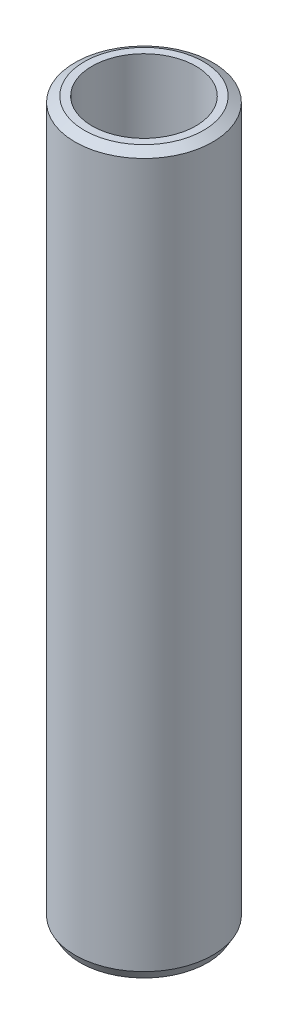
ISO-10303-21;
HEADER;
FILE_DESCRIPTION(('STEP AP214'),'2;1');
FILE_NAME('part.step','',(''),(''),'','','');
FILE_SCHEMA(('AUTOMOTIVE_DESIGN { 1 0 10303 214 1 1 1 1 }'));
ENDSEC;
DATA;
#1=APPLICATION_CONTEXT('core data for automotive mechanical design processes');
#2=APPLICATION_PROTOCOL_DEFINITION('international standard','automotive_design',2000,#1);
#3=PRODUCT_CONTEXT('',#1,'mechanical');
#4=PRODUCT('Part','Part','',(#3));
#5=PRODUCT_RELATED_PRODUCT_CATEGORY('part','',(#4));
#6=PRODUCT_DEFINITION_FORMATION('','',#4);
#7=PRODUCT_DEFINITION_CONTEXT('part definition',#1,'design');
#8=PRODUCT_DEFINITION('design','',#6,#7);
#9=PRODUCT_DEFINITION_SHAPE('','',#8);
#10=(LENGTH_UNIT() NAMED_UNIT(*) SI_UNIT(.MILLI.,.METRE.));
#11=(NAMED_UNIT(*) PLANE_ANGLE_UNIT() SI_UNIT($,.RADIAN.));
#12=(NAMED_UNIT(*) SI_UNIT($,.STERADIAN.) SOLID_ANGLE_UNIT());
#13=UNCERTAINTY_MEASURE_WITH_UNIT(LENGTH_MEASURE(1.E-05),#10,'distance_accuracy_value','');
#14=(GEOMETRIC_REPRESENTATION_CONTEXT(3) GLOBAL_UNCERTAINTY_ASSIGNED_CONTEXT((#13)) GLOBAL_UNIT_ASSIGNED_CONTEXT((#10,
#11,#12)) REPRESENTATION_CONTEXT('',''));
#15=CARTESIAN_POINT('',(0.,0.,0.));
#16=DIRECTION('',(0.,0.,1.));
#17=DIRECTION('',(1.,0.,0.));
#18=AXIS2_PLACEMENT_3D('',#15,#16,#17);
#19=CARTESIAN_POINT('',(0.,600.,0.));
#20=DIRECTION('',(0.,-1.,0.));
#21=DIRECTION('',(0.,0.,-1.));
#22=AXIS2_PLACEMENT_3D('',#19,#20,#21);
#23=CYLINDRICAL_SURFACE('',#22,57.5);
#24=CARTESIAN_POINT('',(0.,595.505160988758,0.));
#25=DIRECTION('',(0.,1.,0.));
#26=DIRECTION('',(0.,0.,1.));
#27=AXIS2_PLACEMENT_3D('',#24,#25,#26);
#28=CIRCLE('',#27,57.5);
#29=CARTESIAN_POINT('',(0.,595.505160988758,57.5));
#30=VERTEX_POINT('',#29);
#31=EDGE_CURVE('E50',#30,#30,#28,.F.);
#32=ORIENTED_EDGE('',*,*,#31,.T.);
#33=EDGE_LOOP('',(#32));
#34=FACE_BOUND('',#33,.T.);
#35=CARTESIAN_POINT('',(0.,7.78528953931412,0.));
#36=DIRECTION('',(0.,1.,0.));
#37=DIRECTION('',(0.,0.,1.));
#38=AXIS2_PLACEMENT_3D('',#35,#36,#37);
#39=CIRCLE('',#38,57.5);
#40=CARTESIAN_POINT('',(0.,7.78528953931412,57.5));
#41=VERTEX_POINT('',#40);
#42=EDGE_CURVE('E51',#41,#41,#39,.T.);
#43=ORIENTED_EDGE('',*,*,#42,.T.);
#44=EDGE_LOOP('',(#43));
#45=FACE_BOUND('',#44,.T.);
#46=ADVANCED_FACE('F39',(#34,#45),#23,.T.);
#47=CARTESIAN_POINT('',(0.,600.,0.));
#48=DIRECTION('',(0.,1.,0.));
#49=DIRECTION('',(0.,0.,1.));
#50=AXIS2_PLACEMENT_3D('',#47,#48,#49);
#51=PLANE('',#50);
#52=CARTESIAN_POINT('',(0.,600.,0.));
#53=DIRECTION('',(0.,1.,0.));
#54=DIRECTION('',(0.,0.,1.));
#55=AXIS2_PLACEMENT_3D('',#52,#53,#54);
#56=CIRCLE('',#55,49.7147104606859);
#57=CARTESIAN_POINT('',(0.,600.,49.7147104606859));
#58=VERTEX_POINT('',#57);
#59=EDGE_CURVE('E54',#58,#58,#56,.T.);
#60=ORIENTED_EDGE('',*,*,#59,.T.);
#61=EDGE_LOOP('',(#60));
#62=FACE_BOUND('',#61,.T.);
#63=CARTESIAN_POINT('',(0.,600.,0.));
#64=DIRECTION('',(0.,1.,0.));
#65=DIRECTION('',(0.,0.,1.));
#66=AXIS2_PLACEMENT_3D('',#63,#64,#65);
#67=CIRCLE('',#66,43.2916691874936);
#68=CARTESIAN_POINT('',(0.,600.,43.2916691874936));
#69=VERTEX_POINT('',#68);
#70=EDGE_CURVE('E58',#69,#69,#67,.T.);
#71=ORIENTED_EDGE('',*,*,#70,.F.);
#72=EDGE_LOOP('',(#71));
#73=FACE_BOUND('',#72,.T.);
#74=ADVANCED_FACE('F69',(#62,#73),#51,.T.);
#75=CARTESIAN_POINT('',(0.,0.,0.));
#76=DIRECTION('',(0.,1.,0.));
#77=DIRECTION('',(0.,0.,1.));
#78=AXIS2_PLACEMENT_3D('',#75,#76,#77);
#79=PLANE('',#78);
#80=CARTESIAN_POINT('',(0.,0.,0.));
#81=DIRECTION('',(0.,1.,0.));
#82=DIRECTION('',(0.,0.,1.));
#83=AXIS2_PLACEMENT_3D('',#80,#81,#82);
#84=CIRCLE('',#83,53.0051609887578);
#85=CARTESIAN_POINT('',(0.,0.,53.0051609887578));
#86=VERTEX_POINT('',#85);
#87=EDGE_CURVE('E10',#86,#86,#84,.F.);
#88=ORIENTED_EDGE('',*,*,#87,.T.);
#89=EDGE_LOOP('',(#88));
#90=FACE_BOUND('',#89,.T.);
#91=CARTESIAN_POINT('',(0.,0.,0.));
#92=DIRECTION('',(0.,1.,0.));
#93=DIRECTION('',(0.,0.,1.));
#94=AXIS2_PLACEMENT_3D('',#91,#92,#93);
#95=CIRCLE('',#94,43.2916691874936);
#96=CARTESIAN_POINT('',(0.,0.,43.2916691874936));
#97=VERTEX_POINT('',#96);
#98=EDGE_CURVE('E63',#97,#97,#95,.T.);
#99=ORIENTED_EDGE('',*,*,#98,.T.);
#100=EDGE_LOOP('',(#99));
#101=FACE_BOUND('',#100,.T.);
#102=ADVANCED_FACE('F75',(#90,#101),#79,.F.);
#103=CARTESIAN_POINT('',(0.,600.,0.));
#104=DIRECTION('',(0.,-1.,0.));
#105=DIRECTION('',(0.,0.,-1.));
#106=AXIS2_PLACEMENT_3D('',#103,#104,#105);
#107=CYLINDRICAL_SURFACE('',#106,43.2916691874936);
#108=ORIENTED_EDGE('',*,*,#70,.T.);
#109=EDGE_LOOP('',(#108));
#110=FACE_BOUND('',#109,.T.);
#111=ORIENTED_EDGE('',*,*,#98,.F.);
#112=EDGE_LOOP('',(#111));
#113=FACE_BOUND('',#112,.T.);
#114=ADVANCED_FACE('F70',(#110,#113),#107,.F.);
#115=CARTESIAN_POINT('',(0.,600.,0.));
#116=DIRECTION('',(0.,-1.,0.));
#117=DIRECTION('',(0.,0.,-1.));
#118=AXIS2_PLACEMENT_3D('',#115,#116,#117);
#119=CONICAL_SURFACE('',#118,49.7147104606859,1.04719755119658);
#120=ORIENTED_EDGE('',*,*,#31,.F.);
#121=EDGE_LOOP('',(#120));
#122=FACE_BOUND('',#121,.T.);
#123=ORIENTED_EDGE('',*,*,#59,.F.);
#124=EDGE_LOOP('',(#123));
#125=FACE_BOUND('',#124,.T.);
#126=ADVANCED_FACE('F81',(#122,#125),#119,.T.);
#127=CARTESIAN_POINT('',(0.,7.78528953931412,0.));
#128=DIRECTION('',(0.,1.,0.));
#129=DIRECTION('',(0.,0.,1.));
#130=AXIS2_PLACEMENT_3D('',#127,#128,#129);
#131=CONICAL_SURFACE('',#130,57.5,0.523598775598301);
#132=ORIENTED_EDGE('',*,*,#87,.F.);
#133=EDGE_LOOP('',(#132));
#134=FACE_BOUND('',#133,.T.);
#135=ORIENTED_EDGE('',*,*,#42,.F.);
#136=EDGE_LOOP('',(#135));
#137=FACE_BOUND('',#136,.T.);
#138=ADVANCED_FACE('F45',(#134,#137),#131,.T.);
#139=CLOSED_SHELL('',(#46,#74,#102,#114,#126,#138));
#140=MANIFOLD_SOLID_BREP('B2',#139);
#141=ADVANCED_BREP_SHAPE_REPRESENTATION('',(#18,#140),#14);
#142=SHAPE_DEFINITION_REPRESENTATION(#9,#141);
ENDSEC;
END-ISO-10303-21;
